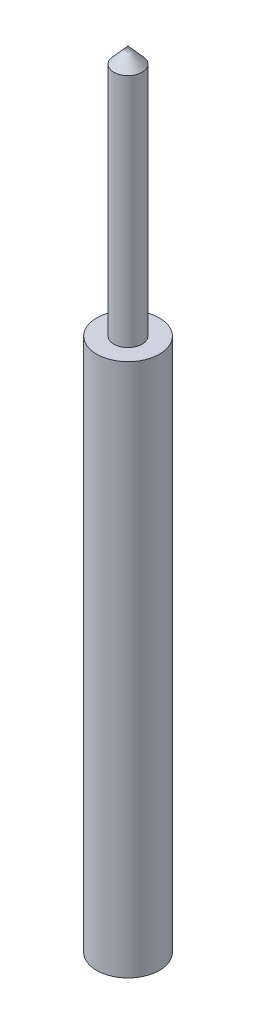
ISO-10303-21;
HEADER;
FILE_DESCRIPTION(('STEP AP214'),'2;1');
FILE_NAME('part.step','',(''),(''),'','','');
FILE_SCHEMA(('AUTOMOTIVE_DESIGN { 1 0 10303 214 1 1 1 1 }'));
ENDSEC;
DATA;
#1=APPLICATION_CONTEXT('core data for automotive mechanical design processes');
#2=APPLICATION_PROTOCOL_DEFINITION('international standard','automotive_design',2000,#1);
#3=PRODUCT_CONTEXT('',#1,'mechanical');
#4=PRODUCT('Part','Part','',(#3));
#5=PRODUCT_RELATED_PRODUCT_CATEGORY('part','',(#4));
#6=PRODUCT_DEFINITION_FORMATION('','',#4);
#7=PRODUCT_DEFINITION_CONTEXT('part definition',#1,'design');
#8=PRODUCT_DEFINITION('design','',#6,#7);
#9=PRODUCT_DEFINITION_SHAPE('','',#8);
#10=(LENGTH_UNIT() NAMED_UNIT(*) SI_UNIT(.MILLI.,.METRE.));
#11=(NAMED_UNIT(*) PLANE_ANGLE_UNIT() SI_UNIT($,.RADIAN.));
#12=(NAMED_UNIT(*) SI_UNIT($,.STERADIAN.) SOLID_ANGLE_UNIT());
#13=UNCERTAINTY_MEASURE_WITH_UNIT(LENGTH_MEASURE(1.E-05),#10,'distance_accuracy_value','');
#14=(GEOMETRIC_REPRESENTATION_CONTEXT(3) GLOBAL_UNCERTAINTY_ASSIGNED_CONTEXT((#13)) GLOBAL_UNIT_ASSIGNED_CONTEXT((#10,
#11,#12)) REPRESENTATION_CONTEXT('',''));
#15=CARTESIAN_POINT('',(0.,0.,0.));
#16=DIRECTION('',(0.,0.,1.));
#17=DIRECTION('',(1.,0.,0.));
#18=AXIS2_PLACEMENT_3D('',#15,#16,#17);
#19=CARTESIAN_POINT('',(0.,24.5,0.));
#20=DIRECTION('',(0.,-1.,0.));
#21=DIRECTION('',(0.,0.,-1.));
#22=AXIS2_PLACEMENT_3D('',#19,#20,#21);
#23=CONICAL_SURFACE('',#22,0.45,0.732815101786506);
#24=CARTESIAN_POINT('',(0.,25.,0.));
#25=VERTEX_POINT('',#24);
#26=VERTEX_LOOP('',#25);
#27=FACE_BOUND('',#26,.T.);
#28=CARTESIAN_POINT('',(0.,24.5,0.));
#29=DIRECTION('',(0.,-1.,0.));
#30=DIRECTION('',(0.,0.,-1.));
#31=AXIS2_PLACEMENT_3D('',#28,#29,#30);
#32=CIRCLE('',#31,0.45);
#33=CARTESIAN_POINT('',(0.,24.5,-0.45));
#34=VERTEX_POINT('',#33);
#35=EDGE_CURVE('E11',#34,#34,#32,.T.);
#36=ORIENTED_EDGE('',*,*,#35,.F.);
#37=EDGE_LOOP('',(#36));
#38=FACE_BOUND('',#37,.T.);
#39=ADVANCED_FACE('F33',(#27,#38),#23,.T.);
#40=CARTESIAN_POINT('',(0.,0.,0.));
#41=DIRECTION('',(0.,-1.,0.));
#42=DIRECTION('',(0.,0.,-1.));
#43=AXIS2_PLACEMENT_3D('',#40,#41,#42);
#44=CYLINDRICAL_SURFACE('',#43,0.45);
#45=ORIENTED_EDGE('',*,*,#35,.T.);
#46=EDGE_LOOP('',(#45));
#47=FACE_BOUND('',#46,.T.);
#48=CARTESIAN_POINT('',(0.,17.,0.));
#49=DIRECTION('',(0.,-1.,0.));
#50=DIRECTION('',(0.,0.,-1.));
#51=AXIS2_PLACEMENT_3D('',#48,#49,#50);
#52=CIRCLE('',#51,0.450000000000001);
#53=CARTESIAN_POINT('',(0.,17.,-0.450000000000001));
#54=VERTEX_POINT('',#53);
#55=EDGE_CURVE('E39',#54,#54,#52,.T.);
#56=ORIENTED_EDGE('',*,*,#55,.F.);
#57=EDGE_LOOP('',(#56));
#58=FACE_BOUND('',#57,.T.);
#59=ADVANCED_FACE('F44',(#47,#58),#44,.T.);
#60=CARTESIAN_POINT('',(0.450000000000001,17.,0.));
#61=DIRECTION('',(0.,1.,0.));
#62=DIRECTION('',(0.,0.,1.));
#63=AXIS2_PLACEMENT_3D('',#60,#61,#62);
#64=PLANE('',#63);
#65=ORIENTED_EDGE('',*,*,#55,.T.);
#66=EDGE_LOOP('',(#65));
#67=FACE_BOUND('',#66,.T.);
#68=CARTESIAN_POINT('',(0.,17.,0.));
#69=DIRECTION('',(0.,-1.,0.));
#70=DIRECTION('',(0.,0.,-1.));
#71=AXIS2_PLACEMENT_3D('',#68,#69,#70);
#72=CIRCLE('',#71,1.);
#73=CARTESIAN_POINT('',(0.,17.,-1.));
#74=VERTEX_POINT('',#73);
#75=EDGE_CURVE('E53',#74,#74,#72,.T.);
#76=ORIENTED_EDGE('',*,*,#75,.F.);
#77=EDGE_LOOP('',(#76));
#78=FACE_BOUND('',#77,.T.);
#79=ADVANCED_FACE('F49',(#67,#78),#64,.T.);
#80=CARTESIAN_POINT('',(0.,0.,0.));
#81=DIRECTION('',(0.,-1.,0.));
#82=DIRECTION('',(0.,0.,-1.));
#83=AXIS2_PLACEMENT_3D('',#80,#81,#82);
#84=CYLINDRICAL_SURFACE('',#83,1.);
#85=ORIENTED_EDGE('',*,*,#75,.T.);
#86=EDGE_LOOP('',(#85));
#87=FACE_BOUND('',#86,.T.);
#88=CARTESIAN_POINT('',(0.,0.,0.));
#89=DIRECTION('',(0.,-1.,0.));
#90=DIRECTION('',(0.,0.,-1.));
#91=AXIS2_PLACEMENT_3D('',#88,#89,#90);
#92=CIRCLE('',#91,1.);
#93=CARTESIAN_POINT('',(0.,0.,-1.));
#94=VERTEX_POINT('',#93);
#95=EDGE_CURVE('E55',#94,#94,#92,.T.);
#96=ORIENTED_EDGE('',*,*,#95,.F.);
#97=EDGE_LOOP('',(#96));
#98=FACE_BOUND('',#97,.T.);
#99=ADVANCED_FACE('F63',(#87,#98),#84,.T.);
#100=CARTESIAN_POINT('',(1.,0.,0.));
#101=DIRECTION('',(0.,-1.,0.));
#102=DIRECTION('',(0.,0.,-1.));
#103=AXIS2_PLACEMENT_3D('',#100,#101,#102);
#104=PLANE('',#103);
#105=ORIENTED_EDGE('',*,*,#95,.T.);
#106=EDGE_LOOP('',(#105));
#107=FACE_BOUND('',#106,.T.);
#108=ADVANCED_FACE('F61',(#107),#104,.T.);
#109=CLOSED_SHELL('',(#39,#59,#79,#99,#108));
#110=MANIFOLD_SOLID_BREP('B2',#109);
#111=ADVANCED_BREP_SHAPE_REPRESENTATION('',(#18,#110),#14);
#112=SHAPE_DEFINITION_REPRESENTATION(#9,#111);
ENDSEC;
END-ISO-10303-21;
